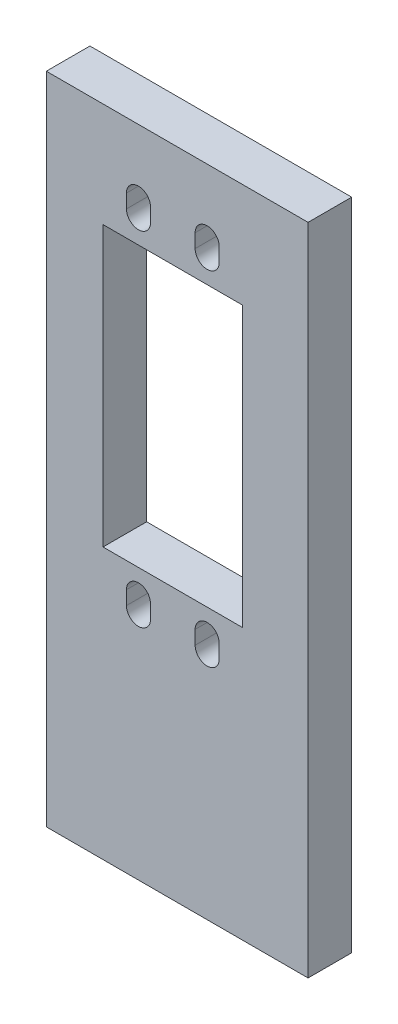
ISO-10303-21;
HEADER;
FILE_DESCRIPTION(('STEP AP214'),'2;1');
FILE_NAME('part.step','',(''),(''),'','','');
FILE_SCHEMA(('AUTOMOTIVE_DESIGN { 1 0 10303 214 1 1 1 1 }'));
ENDSEC;
DATA;
#1=APPLICATION_CONTEXT('core data for automotive mechanical design processes');
#2=APPLICATION_PROTOCOL_DEFINITION('international standard','automotive_design',2000,#1);
#3=PRODUCT_CONTEXT('',#1,'mechanical');
#4=PRODUCT('Part','Part','',(#3));
#5=PRODUCT_RELATED_PRODUCT_CATEGORY('part','',(#4));
#6=PRODUCT_DEFINITION_FORMATION('','',#4);
#7=PRODUCT_DEFINITION_CONTEXT('part definition',#1,'design');
#8=PRODUCT_DEFINITION('design','',#6,#7);
#9=PRODUCT_DEFINITION_SHAPE('','',#8);
#10=(LENGTH_UNIT() NAMED_UNIT(*) SI_UNIT(.MILLI.,.METRE.));
#11=(NAMED_UNIT(*) PLANE_ANGLE_UNIT() SI_UNIT($,.RADIAN.));
#12=(NAMED_UNIT(*) SI_UNIT($,.STERADIAN.) SOLID_ANGLE_UNIT());
#13=UNCERTAINTY_MEASURE_WITH_UNIT(LENGTH_MEASURE(1.E-05),#10,'distance_accuracy_value','');
#14=(GEOMETRIC_REPRESENTATION_CONTEXT(3) GLOBAL_UNCERTAINTY_ASSIGNED_CONTEXT((#13)) GLOBAL_UNIT_ASSIGNED_CONTEXT((#10,
#11,#12)) REPRESENTATION_CONTEXT('',''));
#15=CARTESIAN_POINT('',(0.,0.,0.));
#16=DIRECTION('',(0.,0.,1.));
#17=DIRECTION('',(1.,0.,0.));
#18=AXIS2_PLACEMENT_3D('',#15,#16,#17);
#19=CARTESIAN_POINT('',(0.,0.,6.35));
#20=DIRECTION('',(1.,0.,0.));
#21=DIRECTION('',(0.,0.,-1.));
#22=AXIS2_PLACEMENT_3D('',#19,#20,#21);
#23=PLANE('',#22);
#24=DIRECTION('',(0.,-1.,0.));
#25=VECTOR('',#24,1.);
#26=CARTESIAN_POINT('',(0.,0.,0.));
#27=LINE('',#26,#25);
#28=CARTESIAN_POINT('',(0.,95.25,0.));
#29=VERTEX_POINT('',#28);
#30=CARTESIAN_POINT('',(0.,0.,0.));
#31=VERTEX_POINT('',#30);
#32=EDGE_CURVE('E353',#29,#31,#27,.T.);
#33=ORIENTED_EDGE('',*,*,#32,.T.);
#34=DIRECTION('',(0.,0.,-1.));
#35=VECTOR('',#34,1.);
#36=CARTESIAN_POINT('',(0.,0.,6.35));
#37=LINE('',#36,#35);
#38=CARTESIAN_POINT('',(0.,0.,6.35));
#39=VERTEX_POINT('',#38);
#40=EDGE_CURVE('E11',#39,#31,#37,.T.);
#41=ORIENTED_EDGE('',*,*,#40,.F.);
#42=DIRECTION('',(0.,-1.,0.));
#43=VECTOR('',#42,1.);
#44=CARTESIAN_POINT('',(0.,0.,6.35));
#45=LINE('',#44,#43);
#46=CARTESIAN_POINT('',(0.,95.25,6.35));
#47=VERTEX_POINT('',#46);
#48=EDGE_CURVE('E360',#47,#39,#45,.T.);
#49=ORIENTED_EDGE('',*,*,#48,.F.);
#50=DIRECTION('',(0.,0.,-1.));
#51=VECTOR('',#50,1.);
#52=CARTESIAN_POINT('',(0.,95.25,6.35));
#53=LINE('',#52,#51);
#54=EDGE_CURVE('E370',#47,#29,#53,.T.);
#55=ORIENTED_EDGE('',*,*,#54,.T.);
#56=EDGE_LOOP('',(#33,#41,#49,#55));
#57=FACE_BOUND('',#56,.T.);
#58=ADVANCED_FACE('F35',(#57),#23,.F.);
#59=CARTESIAN_POINT('',(0.,0.,6.35));
#60=DIRECTION('',(0.,1.,0.));
#61=DIRECTION('',(0.,0.,1.));
#62=AXIS2_PLACEMENT_3D('',#59,#60,#61);
#63=PLANE('',#62);
#64=DIRECTION('',(1.,0.,0.));
#65=VECTOR('',#64,1.);
#66=CARTESIAN_POINT('',(0.,0.,0.));
#67=LINE('',#66,#65);
#68=CARTESIAN_POINT('',(38.1,0.,0.));
#69=VERTEX_POINT('',#68);
#70=EDGE_CURVE('E373',#31,#69,#67,.T.);
#71=ORIENTED_EDGE('',*,*,#70,.T.);
#72=DIRECTION('',(0.,0.,-1.));
#73=VECTOR('',#72,1.);
#74=CARTESIAN_POINT('',(38.1,0.,6.35));
#75=LINE('',#74,#73);
#76=CARTESIAN_POINT('',(38.1,0.,6.35));
#77=VERTEX_POINT('',#76);
#78=EDGE_CURVE('E42',#77,#69,#75,.T.);
#79=ORIENTED_EDGE('',*,*,#78,.F.);
#80=DIRECTION('',(1.,0.,0.));
#81=VECTOR('',#80,1.);
#82=CARTESIAN_POINT('',(0.,0.,6.35));
#83=LINE('',#82,#81);
#84=EDGE_CURVE('E363',#39,#77,#83,.T.);
#85=ORIENTED_EDGE('',*,*,#84,.F.);
#86=ORIENTED_EDGE('',*,*,#40,.T.);
#87=EDGE_LOOP('',(#71,#79,#85,#86));
#88=FACE_BOUND('',#87,.T.);
#89=ADVANCED_FACE('F402',(#88),#63,.F.);
#90=CARTESIAN_POINT('',(38.1,0.,6.35));
#91=DIRECTION('',(-1.,0.,0.));
#92=DIRECTION('',(0.,0.,1.));
#93=AXIS2_PLACEMENT_3D('',#90,#91,#92);
#94=PLANE('',#93);
#95=DIRECTION('',(0.,1.,0.));
#96=VECTOR('',#95,1.);
#97=CARTESIAN_POINT('',(38.1,0.,0.));
#98=LINE('',#97,#96);
#99=CARTESIAN_POINT('',(38.1,95.25,0.));
#100=VERTEX_POINT('',#99);
#101=EDGE_CURVE('E375',#69,#100,#98,.T.);
#102=ORIENTED_EDGE('',*,*,#101,.T.);
#103=DIRECTION('',(0.,0.,-1.));
#104=VECTOR('',#103,1.);
#105=CARTESIAN_POINT('',(38.1,95.25,6.35));
#106=LINE('',#105,#104);
#107=CARTESIAN_POINT('',(38.1,95.25,6.35));
#108=VERTEX_POINT('',#107);
#109=EDGE_CURVE('E380',#108,#100,#106,.T.);
#110=ORIENTED_EDGE('',*,*,#109,.F.);
#111=DIRECTION('',(0.,1.,0.));
#112=VECTOR('',#111,1.);
#113=CARTESIAN_POINT('',(38.1,0.,6.35));
#114=LINE('',#113,#112);
#115=EDGE_CURVE('E366',#77,#108,#114,.T.);
#116=ORIENTED_EDGE('',*,*,#115,.F.);
#117=ORIENTED_EDGE('',*,*,#78,.T.);
#118=EDGE_LOOP('',(#102,#110,#116,#117));
#119=FACE_BOUND('',#118,.T.);
#120=ADVANCED_FACE('F387',(#119),#94,.F.);
#121=CARTESIAN_POINT('',(0.,95.25,6.35));
#122=DIRECTION('',(0.,-1.,0.));
#123=DIRECTION('',(0.,0.,-1.));
#124=AXIS2_PLACEMENT_3D('',#121,#122,#123);
#125=PLANE('',#124);
#126=DIRECTION('',(-1.,0.,0.));
#127=VECTOR('',#126,1.);
#128=CARTESIAN_POINT('',(0.,95.25,0.));
#129=LINE('',#128,#127);
#130=EDGE_CURVE('E364',#100,#29,#129,.T.);
#131=ORIENTED_EDGE('',*,*,#130,.T.);
#132=ORIENTED_EDGE('',*,*,#54,.F.);
#133=DIRECTION('',(-1.,0.,0.));
#134=VECTOR('',#133,1.);
#135=CARTESIAN_POINT('',(0.,95.25,6.35));
#136=LINE('',#135,#134);
#137=EDGE_CURVE('E368',#108,#47,#136,.T.);
#138=ORIENTED_EDGE('',*,*,#137,.F.);
#139=ORIENTED_EDGE('',*,*,#109,.T.);
#140=EDGE_LOOP('',(#131,#132,#138,#139));
#141=FACE_BOUND('',#140,.T.);
#142=ADVANCED_FACE('F396',(#141),#125,.F.);
#143=CARTESIAN_POINT('',(0.,0.,6.35));
#144=DIRECTION('',(0.,0.,-1.));
#145=DIRECTION('',(-1.,0.,0.));
#146=AXIS2_PLACEMENT_3D('',#143,#144,#145);
#147=PLANE('',#146);
#148=DIRECTION('',(0.,1.,0.));
#149=VECTOR('',#148,1.);
#150=CARTESIAN_POINT('',(11.6649999999998,35.725,6.35));
#151=LINE('',#150,#149);
#152=CARTESIAN_POINT('',(11.6649999999999,33.725,6.35));
#153=VERTEX_POINT('',#152);
#154=CARTESIAN_POINT('',(11.6649999999998,35.725,6.35));
#155=VERTEX_POINT('',#154);
#156=EDGE_CURVE('E203',#153,#155,#151,.T.);
#157=ORIENTED_EDGE('',*,*,#156,.T.);
#158=CARTESIAN_POINT('',(13.4149999999998,35.725,6.35));
#159=DIRECTION('',(0.,0.,-1.));
#160=DIRECTION('',(-1.,0.,0.));
#161=AXIS2_PLACEMENT_3D('',#158,#159,#160);
#162=CIRCLE('',#161,1.75);
#163=CARTESIAN_POINT('',(15.1649999999998,35.725,6.35));
#164=VERTEX_POINT('',#163);
#165=EDGE_CURVE('E197',#155,#164,#162,.T.);
#166=ORIENTED_EDGE('',*,*,#165,.T.);
#167=DIRECTION('',(0.,-1.,0.));
#168=VECTOR('',#167,1.);
#169=CARTESIAN_POINT('',(15.1649999999998,35.725,6.35));
#170=LINE('',#169,#168);
#171=CARTESIAN_POINT('',(15.1649999999998,33.725,6.35));
#172=VERTEX_POINT('',#171);
#173=EDGE_CURVE('E206',#164,#172,#170,.T.);
#174=ORIENTED_EDGE('',*,*,#173,.T.);
#175=CARTESIAN_POINT('',(13.4149999999998,33.725,6.35));
#176=DIRECTION('',(0.,0.,-1.));
#177=DIRECTION('',(-1.,0.,0.));
#178=AXIS2_PLACEMENT_3D('',#175,#176,#177);
#179=CIRCLE('',#178,1.74999999999999);
#180=EDGE_CURVE('E49',#172,#153,#179,.T.);
#181=ORIENTED_EDGE('',*,*,#180,.T.);
#182=EDGE_LOOP('',(#157,#166,#174,#181));
#183=FACE_BOUND('',#182,.T.);
#184=DIRECTION('',(0.,1.,0.));
#185=VECTOR('',#184,1.);
#186=CARTESIAN_POINT('',(21.6649999999998,35.725,6.35));
#187=LINE('',#186,#185);
#188=CARTESIAN_POINT('',(21.6649999999999,33.725,6.35));
#189=VERTEX_POINT('',#188);
#190=CARTESIAN_POINT('',(21.6649999999998,35.725,6.35));
#191=VERTEX_POINT('',#190);
#192=EDGE_CURVE('E242',#189,#191,#187,.T.);
#193=ORIENTED_EDGE('',*,*,#192,.T.);
#194=CARTESIAN_POINT('',(23.4149999999998,35.725,6.35));
#195=DIRECTION('',(0.,0.,-1.));
#196=DIRECTION('',(-1.,0.,0.));
#197=AXIS2_PLACEMENT_3D('',#194,#195,#196);
#198=CIRCLE('',#197,1.74999999999999);
#199=CARTESIAN_POINT('',(25.1649999999998,35.725,6.35));
#200=VERTEX_POINT('',#199);
#201=EDGE_CURVE('E232',#191,#200,#198,.T.);
#202=ORIENTED_EDGE('',*,*,#201,.T.);
#203=DIRECTION('',(0.,-1.,0.));
#204=VECTOR('',#203,1.);
#205=CARTESIAN_POINT('',(25.1649999999998,35.725,6.35));
#206=LINE('',#205,#204);
#207=CARTESIAN_POINT('',(25.1649999999998,33.725,6.35));
#208=VERTEX_POINT('',#207);
#209=EDGE_CURVE('E235',#200,#208,#206,.T.);
#210=ORIENTED_EDGE('',*,*,#209,.T.);
#211=CARTESIAN_POINT('',(23.4149999999998,33.725,6.35));
#212=DIRECTION('',(0.,0.,-1.));
#213=DIRECTION('',(-1.,0.,0.));
#214=AXIS2_PLACEMENT_3D('',#211,#212,#213);
#215=CIRCLE('',#214,1.74999999999999);
#216=EDGE_CURVE('E239',#208,#189,#215,.T.);
#217=ORIENTED_EDGE('',*,*,#216,.T.);
#218=EDGE_LOOP('',(#193,#202,#210,#217));
#219=FACE_BOUND('',#218,.T.);
#220=DIRECTION('',(0.,-1.,0.));
#221=VECTOR('',#220,1.);
#222=CARTESIAN_POINT('',(15.165,83.725,6.35));
#223=LINE('',#222,#221);
#224=CARTESIAN_POINT('',(15.165,85.725,6.35));
#225=VERTEX_POINT('',#224);
#226=CARTESIAN_POINT('',(15.165,83.725,6.35));
#227=VERTEX_POINT('',#226);
#228=EDGE_CURVE('E274',#225,#227,#223,.T.);
#229=ORIENTED_EDGE('',*,*,#228,.T.);
#230=CARTESIAN_POINT('',(13.415,83.725,6.35));
#231=DIRECTION('',(0.,0.,-1.));
#232=DIRECTION('',(-1.,0.,0.));
#233=AXIS2_PLACEMENT_3D('',#230,#231,#232);
#234=CIRCLE('',#233,1.75);
#235=CARTESIAN_POINT('',(11.665,83.725,6.35));
#236=VERTEX_POINT('',#235);
#237=EDGE_CURVE('E264',#227,#236,#234,.T.);
#238=ORIENTED_EDGE('',*,*,#237,.T.);
#239=DIRECTION('',(0.,1.,0.));
#240=VECTOR('',#239,1.);
#241=CARTESIAN_POINT('',(11.665,83.725,6.35));
#242=LINE('',#241,#240);
#243=CARTESIAN_POINT('',(11.665,85.725,6.35));
#244=VERTEX_POINT('',#243);
#245=EDGE_CURVE('E267',#236,#244,#242,.T.);
#246=ORIENTED_EDGE('',*,*,#245,.T.);
#247=CARTESIAN_POINT('',(13.415,85.725,6.35));
#248=DIRECTION('',(0.,0.,-1.));
#249=DIRECTION('',(-1.,0.,0.));
#250=AXIS2_PLACEMENT_3D('',#247,#248,#249);
#251=CIRCLE('',#250,1.75);
#252=EDGE_CURVE('E271',#244,#225,#251,.T.);
#253=ORIENTED_EDGE('',*,*,#252,.T.);
#254=EDGE_LOOP('',(#229,#238,#246,#253));
#255=FACE_BOUND('',#254,.T.);
#256=DIRECTION('',(0.,-1.,0.));
#257=VECTOR('',#256,1.);
#258=CARTESIAN_POINT('',(25.165,83.725,6.35));
#259=LINE('',#258,#257);
#260=CARTESIAN_POINT('',(25.165,85.725,6.35));
#261=VERTEX_POINT('',#260);
#262=CARTESIAN_POINT('',(25.165,83.725,6.35));
#263=VERTEX_POINT('',#262);
#264=EDGE_CURVE('E306',#261,#263,#259,.T.);
#265=ORIENTED_EDGE('',*,*,#264,.T.);
#266=CARTESIAN_POINT('',(23.415,83.725,6.35));
#267=DIRECTION('',(0.,0.,-1.));
#268=DIRECTION('',(-1.,0.,0.));
#269=AXIS2_PLACEMENT_3D('',#266,#267,#268);
#270=CIRCLE('',#269,1.75000000000001);
#271=CARTESIAN_POINT('',(21.665,83.725,6.35));
#272=VERTEX_POINT('',#271);
#273=EDGE_CURVE('E296',#263,#272,#270,.T.);
#274=ORIENTED_EDGE('',*,*,#273,.T.);
#275=DIRECTION('',(0.,1.,0.));
#276=VECTOR('',#275,1.);
#277=CARTESIAN_POINT('',(21.665,83.725,6.35));
#278=LINE('',#277,#276);
#279=CARTESIAN_POINT('',(21.665,85.725,6.35));
#280=VERTEX_POINT('',#279);
#281=EDGE_CURVE('E299',#272,#280,#278,.T.);
#282=ORIENTED_EDGE('',*,*,#281,.T.);
#283=CARTESIAN_POINT('',(23.415,85.725,6.35));
#284=DIRECTION('',(0.,0.,-1.));
#285=DIRECTION('',(-1.,0.,0.));
#286=AXIS2_PLACEMENT_3D('',#283,#284,#285);
#287=CIRCLE('',#286,1.75000000000001);
#288=EDGE_CURVE('E303',#280,#261,#287,.T.);
#289=ORIENTED_EDGE('',*,*,#288,.T.);
#290=EDGE_LOOP('',(#265,#274,#282,#289));
#291=FACE_BOUND('',#290,.T.);
#292=DIRECTION('',(0.,-1.,0.));
#293=VECTOR('',#292,1.);
#294=CARTESIAN_POINT('',(28.575,80.045,6.35));
#295=LINE('',#294,#293);
#296=CARTESIAN_POINT('',(28.575,80.045,6.35));
#297=VERTEX_POINT('',#296);
#298=CARTESIAN_POINT('',(28.5749999999999,39.405,6.35));
#299=VERTEX_POINT('',#298);
#300=EDGE_CURVE('E338',#297,#299,#295,.T.);
#301=ORIENTED_EDGE('',*,*,#300,.T.);
#302=DIRECTION('',(-1.,0.,0.));
#303=VECTOR('',#302,1.);
#304=CARTESIAN_POINT('',(8.25499999999986,39.405,6.35));
#305=LINE('',#304,#303);
#306=CARTESIAN_POINT('',(8.25499999999986,39.405,6.35));
#307=VERTEX_POINT('',#306);
#308=EDGE_CURVE('E328',#299,#307,#305,.T.);
#309=ORIENTED_EDGE('',*,*,#308,.T.);
#310=DIRECTION('',(0.,1.,0.));
#311=VECTOR('',#310,1.);
#312=CARTESIAN_POINT('',(8.25500000000001,80.045,6.35));
#313=LINE('',#312,#311);
#314=CARTESIAN_POINT('',(8.25500000000001,80.045,6.35));
#315=VERTEX_POINT('',#314);
#316=EDGE_CURVE('E331',#307,#315,#313,.T.);
#317=ORIENTED_EDGE('',*,*,#316,.T.);
#318=DIRECTION('',(1.,0.,0.));
#319=VECTOR('',#318,1.);
#320=CARTESIAN_POINT('',(8.25500000000001,80.045,6.35));
#321=LINE('',#320,#319);
#322=EDGE_CURVE('E335',#315,#297,#321,.T.);
#323=ORIENTED_EDGE('',*,*,#322,.T.);
#324=EDGE_LOOP('',(#301,#309,#317,#323));
#325=FACE_BOUND('',#324,.T.);
#326=ORIENTED_EDGE('',*,*,#48,.T.);
#327=ORIENTED_EDGE('',*,*,#84,.T.);
#328=ORIENTED_EDGE('',*,*,#115,.T.);
#329=ORIENTED_EDGE('',*,*,#137,.T.);
#330=EDGE_LOOP('',(#326,#327,#328,#329));
#331=FACE_BOUND('',#330,.T.);
#332=ADVANCED_FACE('F210',(#183,#219,#255,#291,#325,#331),#147,.F.);
#333=CARTESIAN_POINT('',(0.,0.,0.));
#334=DIRECTION('',(0.,0.,-1.));
#335=DIRECTION('',(-1.,0.,0.));
#336=AXIS2_PLACEMENT_3D('',#333,#334,#335);
#337=PLANE('',#336);
#338=CARTESIAN_POINT('',(13.4149999999998,35.725,0.));
#339=DIRECTION('',(0.,0.,-1.));
#340=DIRECTION('',(-1.,0.,0.));
#341=AXIS2_PLACEMENT_3D('',#338,#339,#340);
#342=CIRCLE('',#341,1.75);
#343=CARTESIAN_POINT('',(11.6649999999998,35.725,0.));
#344=VERTEX_POINT('',#343);
#345=CARTESIAN_POINT('',(15.1649999999998,35.725,0.));
#346=VERTEX_POINT('',#345);
#347=EDGE_CURVE('E57',#344,#346,#342,.T.);
#348=ORIENTED_EDGE('',*,*,#347,.F.);
#349=DIRECTION('',(0.,1.,0.));
#350=VECTOR('',#349,1.);
#351=CARTESIAN_POINT('',(11.6649999999998,35.725,0.));
#352=LINE('',#351,#350);
#353=CARTESIAN_POINT('',(11.6649999999999,33.725,0.));
#354=VERTEX_POINT('',#353);
#355=EDGE_CURVE('E213',#354,#344,#352,.T.);
#356=ORIENTED_EDGE('',*,*,#355,.F.);
#357=CARTESIAN_POINT('',(13.4149999999998,33.725,0.));
#358=DIRECTION('',(0.,0.,-1.));
#359=DIRECTION('',(-1.,0.,0.));
#360=AXIS2_PLACEMENT_3D('',#357,#358,#359);
#361=CIRCLE('',#360,1.74999999999999);
#362=CARTESIAN_POINT('',(15.1649999999998,33.725,0.));
#363=VERTEX_POINT('',#362);
#364=EDGE_CURVE('E216',#363,#354,#361,.T.);
#365=ORIENTED_EDGE('',*,*,#364,.F.);
#366=DIRECTION('',(0.,-1.,0.));
#367=VECTOR('',#366,1.);
#368=CARTESIAN_POINT('',(15.1649999999998,35.725,0.));
#369=LINE('',#368,#367);
#370=EDGE_CURVE('E222',#346,#363,#369,.T.);
#371=ORIENTED_EDGE('',*,*,#370,.F.);
#372=EDGE_LOOP('',(#348,#356,#365,#371));
#373=FACE_BOUND('',#372,.T.);
#374=CARTESIAN_POINT('',(23.4149999999998,35.725,0.));
#375=DIRECTION('',(0.,0.,-1.));
#376=DIRECTION('',(-1.,0.,0.));
#377=AXIS2_PLACEMENT_3D('',#374,#375,#376);
#378=CIRCLE('',#377,1.74999999999999);
#379=CARTESIAN_POINT('',(21.6649999999998,35.725,0.));
#380=VERTEX_POINT('',#379);
#381=CARTESIAN_POINT('',(25.1649999999998,35.725,0.));
#382=VERTEX_POINT('',#381);
#383=EDGE_CURVE('E228',#380,#382,#378,.T.);
#384=ORIENTED_EDGE('',*,*,#383,.F.);
#385=DIRECTION('',(0.,1.,0.));
#386=VECTOR('',#385,1.);
#387=CARTESIAN_POINT('',(21.6649999999998,35.725,0.));
#388=LINE('',#387,#386);
#389=CARTESIAN_POINT('',(21.6649999999999,33.725,0.));
#390=VERTEX_POINT('',#389);
#391=EDGE_CURVE('E236',#390,#380,#388,.T.);
#392=ORIENTED_EDGE('',*,*,#391,.F.);
#393=CARTESIAN_POINT('',(23.4149999999998,33.725,0.));
#394=DIRECTION('',(0.,0.,-1.));
#395=DIRECTION('',(-1.,0.,0.));
#396=AXIS2_PLACEMENT_3D('',#393,#394,#395);
#397=CIRCLE('',#396,1.74999999999999);
#398=CARTESIAN_POINT('',(25.1649999999998,33.725,0.));
#399=VERTEX_POINT('',#398);
#400=EDGE_CURVE('E250',#399,#390,#397,.T.);
#401=ORIENTED_EDGE('',*,*,#400,.F.);
#402=DIRECTION('',(0.,-1.,0.));
#403=VECTOR('',#402,1.);
#404=CARTESIAN_POINT('',(25.1649999999998,35.725,0.));
#405=LINE('',#404,#403);
#406=EDGE_CURVE('E247',#382,#399,#405,.T.);
#407=ORIENTED_EDGE('',*,*,#406,.F.);
#408=EDGE_LOOP('',(#384,#392,#401,#407));
#409=FACE_BOUND('',#408,.T.);
#410=CARTESIAN_POINT('',(13.415,83.725,0.));
#411=DIRECTION('',(0.,0.,-1.));
#412=DIRECTION('',(-1.,0.,0.));
#413=AXIS2_PLACEMENT_3D('',#410,#411,#412);
#414=CIRCLE('',#413,1.75);
#415=CARTESIAN_POINT('',(15.165,83.725,0.));
#416=VERTEX_POINT('',#415);
#417=CARTESIAN_POINT('',(11.665,83.725,0.));
#418=VERTEX_POINT('',#417);
#419=EDGE_CURVE('E257',#416,#418,#414,.T.);
#420=ORIENTED_EDGE('',*,*,#419,.F.);
#421=DIRECTION('',(0.,-1.,0.));
#422=VECTOR('',#421,1.);
#423=CARTESIAN_POINT('',(15.165,83.725,0.));
#424=LINE('',#423,#422);
#425=CARTESIAN_POINT('',(15.165,85.725,0.));
#426=VERTEX_POINT('',#425);
#427=EDGE_CURVE('E268',#426,#416,#424,.T.);
#428=ORIENTED_EDGE('',*,*,#427,.F.);
#429=CARTESIAN_POINT('',(13.415,85.725,0.));
#430=DIRECTION('',(0.,0.,-1.));
#431=DIRECTION('',(-1.,0.,0.));
#432=AXIS2_PLACEMENT_3D('',#429,#430,#431);
#433=CIRCLE('',#432,1.75);
#434=CARTESIAN_POINT('',(11.665,85.725,0.));
#435=VERTEX_POINT('',#434);
#436=EDGE_CURVE('E282',#435,#426,#433,.T.);
#437=ORIENTED_EDGE('',*,*,#436,.F.);
#438=DIRECTION('',(0.,1.,0.));
#439=VECTOR('',#438,1.);
#440=CARTESIAN_POINT('',(11.665,83.725,0.));
#441=LINE('',#440,#439);
#442=EDGE_CURVE('E279',#418,#435,#441,.T.);
#443=ORIENTED_EDGE('',*,*,#442,.F.);
#444=EDGE_LOOP('',(#420,#428,#437,#443));
#445=FACE_BOUND('',#444,.T.);
#446=CARTESIAN_POINT('',(23.415,83.725,0.));
#447=DIRECTION('',(0.,0.,-1.));
#448=DIRECTION('',(-1.,0.,0.));
#449=AXIS2_PLACEMENT_3D('',#446,#447,#448);
#450=CIRCLE('',#449,1.75000000000001);
#451=CARTESIAN_POINT('',(25.165,83.725,0.));
#452=VERTEX_POINT('',#451);
#453=CARTESIAN_POINT('',(21.665,83.725,0.));
#454=VERTEX_POINT('',#453);
#455=EDGE_CURVE('E289',#452,#454,#450,.T.);
#456=ORIENTED_EDGE('',*,*,#455,.F.);
#457=DIRECTION('',(0.,-1.,0.));
#458=VECTOR('',#457,1.);
#459=CARTESIAN_POINT('',(25.165,83.725,0.));
#460=LINE('',#459,#458);
#461=CARTESIAN_POINT('',(25.165,85.725,0.));
#462=VERTEX_POINT('',#461);
#463=EDGE_CURVE('E300',#462,#452,#460,.T.);
#464=ORIENTED_EDGE('',*,*,#463,.F.);
#465=CARTESIAN_POINT('',(23.415,85.725,0.));
#466=DIRECTION('',(0.,0.,-1.));
#467=DIRECTION('',(-1.,0.,0.));
#468=AXIS2_PLACEMENT_3D('',#465,#466,#467);
#469=CIRCLE('',#468,1.75000000000001);
#470=CARTESIAN_POINT('',(21.665,85.725,0.));
#471=VERTEX_POINT('',#470);
#472=EDGE_CURVE('E314',#471,#462,#469,.T.);
#473=ORIENTED_EDGE('',*,*,#472,.F.);
#474=DIRECTION('',(0.,1.,0.));
#475=VECTOR('',#474,1.);
#476=CARTESIAN_POINT('',(21.665,83.725,0.));
#477=LINE('',#476,#475);
#478=EDGE_CURVE('E311',#454,#471,#477,.T.);
#479=ORIENTED_EDGE('',*,*,#478,.F.);
#480=EDGE_LOOP('',(#456,#464,#473,#479));
#481=FACE_BOUND('',#480,.T.);
#482=DIRECTION('',(-1.,0.,0.));
#483=VECTOR('',#482,1.);
#484=CARTESIAN_POINT('',(8.25499999999986,39.405,0.));
#485=LINE('',#484,#483);
#486=CARTESIAN_POINT('',(28.5749999999999,39.405,0.));
#487=VERTEX_POINT('',#486);
#488=CARTESIAN_POINT('',(8.25499999999986,39.405,0.));
#489=VERTEX_POINT('',#488);
#490=EDGE_CURVE('E321',#487,#489,#485,.T.);
#491=ORIENTED_EDGE('',*,*,#490,.F.);
#492=DIRECTION('',(0.,-1.,0.));
#493=VECTOR('',#492,1.);
#494=CARTESIAN_POINT('',(28.575,80.045,0.));
#495=LINE('',#494,#493);
#496=CARTESIAN_POINT('',(28.575,80.045,0.));
#497=VERTEX_POINT('',#496);
#498=EDGE_CURVE('E332',#497,#487,#495,.T.);
#499=ORIENTED_EDGE('',*,*,#498,.F.);
#500=DIRECTION('',(1.,0.,0.));
#501=VECTOR('',#500,1.);
#502=CARTESIAN_POINT('',(8.25500000000001,80.045,0.));
#503=LINE('',#502,#501);
#504=CARTESIAN_POINT('',(8.25500000000001,80.045,0.));
#505=VERTEX_POINT('',#504);
#506=EDGE_CURVE('E346',#505,#497,#503,.T.);
#507=ORIENTED_EDGE('',*,*,#506,.F.);
#508=DIRECTION('',(0.,1.,0.));
#509=VECTOR('',#508,1.);
#510=CARTESIAN_POINT('',(8.25500000000001,80.045,0.));
#511=LINE('',#510,#509);
#512=EDGE_CURVE('E343',#489,#505,#511,.T.);
#513=ORIENTED_EDGE('',*,*,#512,.F.);
#514=EDGE_LOOP('',(#491,#499,#507,#513));
#515=FACE_BOUND('',#514,.T.);
#516=ORIENTED_EDGE('',*,*,#32,.F.);
#517=ORIENTED_EDGE('',*,*,#130,.F.);
#518=ORIENTED_EDGE('',*,*,#101,.F.);
#519=ORIENTED_EDGE('',*,*,#70,.F.);
#520=EDGE_LOOP('',(#516,#517,#518,#519));
#521=FACE_BOUND('',#520,.T.);
#522=ADVANCED_FACE('F393',(#373,#409,#445,#481,#515,#521),#337,.T.);
#523=CARTESIAN_POINT('',(8.25499999999986,39.405,6.35));
#524=DIRECTION('',(0.,-1.,0.));
#525=DIRECTION('',(1.,0.,0.));
#526=AXIS2_PLACEMENT_3D('',#523,#524,#525);
#527=PLANE('',#526);
#528=ORIENTED_EDGE('',*,*,#490,.T.);
#529=DIRECTION('',(0.,0.,-1.));
#530=VECTOR('',#529,1.);
#531=CARTESIAN_POINT('',(8.25499999999986,39.405,6.35));
#532=LINE('',#531,#530);
#533=EDGE_CURVE('E341',#307,#489,#532,.T.);
#534=ORIENTED_EDGE('',*,*,#533,.F.);
#535=ORIENTED_EDGE('',*,*,#308,.F.);
#536=DIRECTION('',(0.,0.,-1.));
#537=VECTOR('',#536,1.);
#538=CARTESIAN_POINT('',(28.5749999999999,39.405,6.35));
#539=LINE('',#538,#537);
#540=EDGE_CURVE('E351',#299,#487,#539,.T.);
#541=ORIENTED_EDGE('',*,*,#540,.T.);
#542=EDGE_LOOP('',(#528,#534,#535,#541));
#543=FACE_BOUND('',#542,.T.);
#544=ADVANCED_FACE('F414',(#543),#527,.F.);
#545=CARTESIAN_POINT('',(28.575,80.045,6.35));
#546=DIRECTION('',(1.,0.,0.));
#547=DIRECTION('',(0.,1.,0.));
#548=AXIS2_PLACEMENT_3D('',#545,#546,#547);
#549=PLANE('',#548);
#550=ORIENTED_EDGE('',*,*,#498,.T.);
#551=ORIENTED_EDGE('',*,*,#540,.F.);
#552=ORIENTED_EDGE('',*,*,#300,.F.);
#553=DIRECTION('',(0.,0.,-1.));
#554=VECTOR('',#553,1.);
#555=CARTESIAN_POINT('',(28.575,80.045,6.35));
#556=LINE('',#555,#554);
#557=EDGE_CURVE('E354',#297,#497,#556,.T.);
#558=ORIENTED_EDGE('',*,*,#557,.T.);
#559=EDGE_LOOP('',(#550,#551,#552,#558));
#560=FACE_BOUND('',#559,.T.);
#561=ADVANCED_FACE('F420',(#560),#549,.F.);
#562=CARTESIAN_POINT('',(8.25500000000001,80.045,6.35));
#563=DIRECTION('',(0.,1.,0.));
#564=DIRECTION('',(-1.,0.,0.));
#565=AXIS2_PLACEMENT_3D('',#562,#563,#564);
#566=PLANE('',#565);
#567=ORIENTED_EDGE('',*,*,#506,.T.);
#568=ORIENTED_EDGE('',*,*,#557,.F.);
#569=ORIENTED_EDGE('',*,*,#322,.F.);
#570=DIRECTION('',(0.,0.,-1.));
#571=VECTOR('',#570,1.);
#572=CARTESIAN_POINT('',(8.25500000000001,80.045,6.35));
#573=LINE('',#572,#571);
#574=EDGE_CURVE('E356',#315,#505,#573,.T.);
#575=ORIENTED_EDGE('',*,*,#574,.T.);
#576=EDGE_LOOP('',(#567,#568,#569,#575));
#577=FACE_BOUND('',#576,.T.);
#578=ADVANCED_FACE('F426',(#577),#566,.F.);
#579=CARTESIAN_POINT('',(8.25500000000001,80.045,6.35));
#580=DIRECTION('',(-1.,0.,0.));
#581=DIRECTION('',(0.,-1.,0.));
#582=AXIS2_PLACEMENT_3D('',#579,#580,#581);
#583=PLANE('',#582);
#584=ORIENTED_EDGE('',*,*,#512,.T.);
#585=ORIENTED_EDGE('',*,*,#574,.F.);
#586=ORIENTED_EDGE('',*,*,#316,.F.);
#587=ORIENTED_EDGE('',*,*,#533,.T.);
#588=EDGE_LOOP('',(#584,#585,#586,#587));
#589=FACE_BOUND('',#588,.T.);
#590=ADVANCED_FACE('F422',(#589),#583,.F.);
#591=CARTESIAN_POINT('',(23.415,83.725,6.35));
#592=DIRECTION('',(0.,0.,-1.));
#593=DIRECTION('',(-1.,0.,0.));
#594=AXIS2_PLACEMENT_3D('',#591,#592,#593);
#595=CYLINDRICAL_SURFACE('',#594,1.75000000000001);
#596=ORIENTED_EDGE('',*,*,#455,.T.);
#597=DIRECTION('',(0.,0.,-1.));
#598=VECTOR('',#597,1.);
#599=CARTESIAN_POINT('',(21.665,83.725,6.35));
#600=LINE('',#599,#598);
#601=EDGE_CURVE('E309',#272,#454,#600,.T.);
#602=ORIENTED_EDGE('',*,*,#601,.F.);
#603=ORIENTED_EDGE('',*,*,#273,.F.);
#604=DIRECTION('',(0.,0.,-1.));
#605=VECTOR('',#604,1.);
#606=CARTESIAN_POINT('',(25.165,83.725,6.35));
#607=LINE('',#606,#605);
#608=EDGE_CURVE('E319',#263,#452,#607,.T.);
#609=ORIENTED_EDGE('',*,*,#608,.T.);
#610=EDGE_LOOP('',(#596,#602,#603,#609));
#611=FACE_BOUND('',#610,.T.);
#612=ADVANCED_FACE('F425',(#611),#595,.F.);
#613=CARTESIAN_POINT('',(25.165,83.725,6.35));
#614=DIRECTION('',(1.,0.,0.));
#615=DIRECTION('',(0.,1.,0.));
#616=AXIS2_PLACEMENT_3D('',#613,#614,#615);
#617=PLANE('',#616);
#618=ORIENTED_EDGE('',*,*,#463,.T.);
#619=ORIENTED_EDGE('',*,*,#608,.F.);
#620=ORIENTED_EDGE('',*,*,#264,.F.);
#621=DIRECTION('',(0.,0.,-1.));
#622=VECTOR('',#621,1.);
#623=CARTESIAN_POINT('',(25.165,85.725,6.35));
#624=LINE('',#623,#622);
#625=EDGE_CURVE('E322',#261,#462,#624,.T.);
#626=ORIENTED_EDGE('',*,*,#625,.T.);
#627=EDGE_LOOP('',(#618,#619,#620,#626));
#628=FACE_BOUND('',#627,.T.);
#629=ADVANCED_FACE('F436',(#628),#617,.F.);
#630=CARTESIAN_POINT('',(23.415,85.725,6.35));
#631=DIRECTION('',(0.,0.,-1.));
#632=DIRECTION('',(-1.,0.,0.));
#633=AXIS2_PLACEMENT_3D('',#630,#631,#632);
#634=CYLINDRICAL_SURFACE('',#633,1.75000000000001);
#635=ORIENTED_EDGE('',*,*,#472,.T.);
#636=ORIENTED_EDGE('',*,*,#625,.F.);
#637=ORIENTED_EDGE('',*,*,#288,.F.);
#638=DIRECTION('',(0.,0.,-1.));
#639=VECTOR('',#638,1.);
#640=CARTESIAN_POINT('',(21.665,85.725,6.35));
#641=LINE('',#640,#639);
#642=EDGE_CURVE('E324',#280,#471,#641,.T.);
#643=ORIENTED_EDGE('',*,*,#642,.T.);
#644=EDGE_LOOP('',(#635,#636,#637,#643));
#645=FACE_BOUND('',#644,.T.);
#646=ADVANCED_FACE('F442',(#645),#634,.F.);
#647=CARTESIAN_POINT('',(21.665,83.725,6.35));
#648=DIRECTION('',(-1.,0.,0.));
#649=DIRECTION('',(0.,-1.,0.));
#650=AXIS2_PLACEMENT_3D('',#647,#648,#649);
#651=PLANE('',#650);
#652=ORIENTED_EDGE('',*,*,#478,.T.);
#653=ORIENTED_EDGE('',*,*,#642,.F.);
#654=ORIENTED_EDGE('',*,*,#281,.F.);
#655=ORIENTED_EDGE('',*,*,#601,.T.);
#656=EDGE_LOOP('',(#652,#653,#654,#655));
#657=FACE_BOUND('',#656,.T.);
#658=ADVANCED_FACE('F438',(#657),#651,.F.);
#659=CARTESIAN_POINT('',(13.415,83.725,6.35));
#660=DIRECTION('',(0.,0.,-1.));
#661=DIRECTION('',(-1.,0.,0.));
#662=AXIS2_PLACEMENT_3D('',#659,#660,#661);
#663=CYLINDRICAL_SURFACE('',#662,1.75);
#664=ORIENTED_EDGE('',*,*,#419,.T.);
#665=DIRECTION('',(0.,0.,-1.));
#666=VECTOR('',#665,1.);
#667=CARTESIAN_POINT('',(11.665,83.725,6.35));
#668=LINE('',#667,#666);
#669=EDGE_CURVE('E277',#236,#418,#668,.T.);
#670=ORIENTED_EDGE('',*,*,#669,.F.);
#671=ORIENTED_EDGE('',*,*,#237,.F.);
#672=DIRECTION('',(0.,0.,-1.));
#673=VECTOR('',#672,1.);
#674=CARTESIAN_POINT('',(15.165,83.725,6.35));
#675=LINE('',#674,#673);
#676=EDGE_CURVE('E287',#227,#416,#675,.T.);
#677=ORIENTED_EDGE('',*,*,#676,.T.);
#678=EDGE_LOOP('',(#664,#670,#671,#677));
#679=FACE_BOUND('',#678,.T.);
#680=ADVANCED_FACE('F441',(#679),#663,.F.);
#681=CARTESIAN_POINT('',(15.165,83.725,6.35));
#682=DIRECTION('',(1.,0.,0.));
#683=DIRECTION('',(0.,1.,0.));
#684=AXIS2_PLACEMENT_3D('',#681,#682,#683);
#685=PLANE('',#684);
#686=ORIENTED_EDGE('',*,*,#427,.T.);
#687=ORIENTED_EDGE('',*,*,#676,.F.);
#688=ORIENTED_EDGE('',*,*,#228,.F.);
#689=DIRECTION('',(0.,0.,-1.));
#690=VECTOR('',#689,1.);
#691=CARTESIAN_POINT('',(15.165,85.725,6.35));
#692=LINE('',#691,#690);
#693=EDGE_CURVE('E290',#225,#426,#692,.T.);
#694=ORIENTED_EDGE('',*,*,#693,.T.);
#695=EDGE_LOOP('',(#686,#687,#688,#694));
#696=FACE_BOUND('',#695,.T.);
#697=ADVANCED_FACE('F452',(#696),#685,.F.);
#698=CARTESIAN_POINT('',(13.415,85.725,6.35));
#699=DIRECTION('',(0.,0.,-1.));
#700=DIRECTION('',(-1.,0.,0.));
#701=AXIS2_PLACEMENT_3D('',#698,#699,#700);
#702=CYLINDRICAL_SURFACE('',#701,1.75);
#703=ORIENTED_EDGE('',*,*,#436,.T.);
#704=ORIENTED_EDGE('',*,*,#693,.F.);
#705=ORIENTED_EDGE('',*,*,#252,.F.);
#706=DIRECTION('',(0.,0.,-1.));
#707=VECTOR('',#706,1.);
#708=CARTESIAN_POINT('',(11.665,85.725,6.35));
#709=LINE('',#708,#707);
#710=EDGE_CURVE('E292',#244,#435,#709,.T.);
#711=ORIENTED_EDGE('',*,*,#710,.T.);
#712=EDGE_LOOP('',(#703,#704,#705,#711));
#713=FACE_BOUND('',#712,.T.);
#714=ADVANCED_FACE('F458',(#713),#702,.F.);
#715=CARTESIAN_POINT('',(11.665,83.725,6.35));
#716=DIRECTION('',(-1.,0.,0.));
#717=DIRECTION('',(0.,-1.,0.));
#718=AXIS2_PLACEMENT_3D('',#715,#716,#717);
#719=PLANE('',#718);
#720=ORIENTED_EDGE('',*,*,#442,.T.);
#721=ORIENTED_EDGE('',*,*,#710,.F.);
#722=ORIENTED_EDGE('',*,*,#245,.F.);
#723=ORIENTED_EDGE('',*,*,#669,.T.);
#724=EDGE_LOOP('',(#720,#721,#722,#723));
#725=FACE_BOUND('',#724,.T.);
#726=ADVANCED_FACE('F454',(#725),#719,.F.);
#727=CARTESIAN_POINT('',(23.4149999999998,35.725,6.35));
#728=DIRECTION('',(0.,0.,-1.));
#729=DIRECTION('',(-1.,0.,0.));
#730=AXIS2_PLACEMENT_3D('',#727,#728,#729);
#731=CYLINDRICAL_SURFACE('',#730,1.74999999999999);
#732=ORIENTED_EDGE('',*,*,#383,.T.);
#733=DIRECTION('',(0.,0.,-1.));
#734=VECTOR('',#733,1.);
#735=CARTESIAN_POINT('',(25.1649999999998,35.725,6.35));
#736=LINE('',#735,#734);
#737=EDGE_CURVE('E245',#200,#382,#736,.T.);
#738=ORIENTED_EDGE('',*,*,#737,.F.);
#739=ORIENTED_EDGE('',*,*,#201,.F.);
#740=DIRECTION('',(0.,0.,-1.));
#741=VECTOR('',#740,1.);
#742=CARTESIAN_POINT('',(21.6649999999998,35.725,6.35));
#743=LINE('',#742,#741);
#744=EDGE_CURVE('E255',#191,#380,#743,.T.);
#745=ORIENTED_EDGE('',*,*,#744,.T.);
#746=EDGE_LOOP('',(#732,#738,#739,#745));
#747=FACE_BOUND('',#746,.T.);
#748=ADVANCED_FACE('F457',(#747),#731,.F.);
#749=CARTESIAN_POINT('',(21.6649999999998,35.725,6.35));
#750=DIRECTION('',(-1.,0.,0.));
#751=DIRECTION('',(0.,-1.,0.));
#752=AXIS2_PLACEMENT_3D('',#749,#750,#751);
#753=PLANE('',#752);
#754=ORIENTED_EDGE('',*,*,#391,.T.);
#755=ORIENTED_EDGE('',*,*,#744,.F.);
#756=ORIENTED_EDGE('',*,*,#192,.F.);
#757=DIRECTION('',(0.,0.,-1.));
#758=VECTOR('',#757,1.);
#759=CARTESIAN_POINT('',(21.6649999999999,33.725,6.35));
#760=LINE('',#759,#758);
#761=EDGE_CURVE('E258',#189,#390,#760,.T.);
#762=ORIENTED_EDGE('',*,*,#761,.T.);
#763=EDGE_LOOP('',(#754,#755,#756,#762));
#764=FACE_BOUND('',#763,.T.);
#765=ADVANCED_FACE('F468',(#764),#753,.F.);
#766=CARTESIAN_POINT('',(23.4149999999998,33.725,6.35));
#767=DIRECTION('',(0.,0.,-1.));
#768=DIRECTION('',(-1.,0.,0.));
#769=AXIS2_PLACEMENT_3D('',#766,#767,#768);
#770=CYLINDRICAL_SURFACE('',#769,1.74999999999999);
#771=ORIENTED_EDGE('',*,*,#400,.T.);
#772=ORIENTED_EDGE('',*,*,#761,.F.);
#773=ORIENTED_EDGE('',*,*,#216,.F.);
#774=DIRECTION('',(0.,0.,-1.));
#775=VECTOR('',#774,1.);
#776=CARTESIAN_POINT('',(25.1649999999998,33.725,6.35));
#777=LINE('',#776,#775);
#778=EDGE_CURVE('E260',#208,#399,#777,.T.);
#779=ORIENTED_EDGE('',*,*,#778,.T.);
#780=EDGE_LOOP('',(#771,#772,#773,#779));
#781=FACE_BOUND('',#780,.T.);
#782=ADVANCED_FACE('F473',(#781),#770,.F.);
#783=CARTESIAN_POINT('',(25.1649999999998,35.725,6.35));
#784=DIRECTION('',(1.,0.,0.));
#785=DIRECTION('',(0.,0.,-1.));
#786=AXIS2_PLACEMENT_3D('',#783,#784,#785);
#787=PLANE('',#786);
#788=ORIENTED_EDGE('',*,*,#406,.T.);
#789=ORIENTED_EDGE('',*,*,#778,.F.);
#790=ORIENTED_EDGE('',*,*,#209,.F.);
#791=ORIENTED_EDGE('',*,*,#737,.T.);
#792=EDGE_LOOP('',(#788,#789,#790,#791));
#793=FACE_BOUND('',#792,.T.);
#794=ADVANCED_FACE('F470',(#793),#787,.F.);
#795=CARTESIAN_POINT('',(13.4149999999998,35.725,6.35));
#796=DIRECTION('',(0.,0.,-1.));
#797=DIRECTION('',(-1.,0.,0.));
#798=AXIS2_PLACEMENT_3D('',#795,#796,#797);
#799=CYLINDRICAL_SURFACE('',#798,1.75);
#800=ORIENTED_EDGE('',*,*,#347,.T.);
#801=DIRECTION('',(0.,0.,-1.));
#802=VECTOR('',#801,1.);
#803=CARTESIAN_POINT('',(15.1649999999998,35.725,6.35));
#804=LINE('',#803,#802);
#805=EDGE_CURVE('E193',#164,#346,#804,.T.);
#806=ORIENTED_EDGE('',*,*,#805,.F.);
#807=ORIENTED_EDGE('',*,*,#165,.F.);
#808=DIRECTION('',(0.,0.,-1.));
#809=VECTOR('',#808,1.);
#810=CARTESIAN_POINT('',(11.6649999999998,35.725,6.35));
#811=LINE('',#810,#809);
#812=EDGE_CURVE('E226',#155,#344,#811,.T.);
#813=ORIENTED_EDGE('',*,*,#812,.T.);
#814=EDGE_LOOP('',(#800,#806,#807,#813));
#815=FACE_BOUND('',#814,.T.);
#816=ADVANCED_FACE('F195',(#815),#799,.F.);
#817=CARTESIAN_POINT('',(11.6649999999998,35.725,6.35));
#818=DIRECTION('',(-1.,0.,0.));
#819=DIRECTION('',(0.,-1.,0.));
#820=AXIS2_PLACEMENT_3D('',#817,#818,#819);
#821=PLANE('',#820);
#822=ORIENTED_EDGE('',*,*,#355,.T.);
#823=ORIENTED_EDGE('',*,*,#812,.F.);
#824=ORIENTED_EDGE('',*,*,#156,.F.);
#825=DIRECTION('',(0.,0.,-1.));
#826=VECTOR('',#825,1.);
#827=CARTESIAN_POINT('',(11.6649999999999,33.725,6.35));
#828=LINE('',#827,#826);
#829=EDGE_CURVE('E229',#153,#354,#828,.T.);
#830=ORIENTED_EDGE('',*,*,#829,.T.);
#831=EDGE_LOOP('',(#822,#823,#824,#830));
#832=FACE_BOUND('',#831,.T.);
#833=ADVANCED_FACE('F483',(#832),#821,.F.);
#834=CARTESIAN_POINT('',(13.4149999999998,33.725,6.35));
#835=DIRECTION('',(0.,0.,-1.));
#836=DIRECTION('',(-1.,0.,0.));
#837=AXIS2_PLACEMENT_3D('',#834,#835,#836);
#838=CYLINDRICAL_SURFACE('',#837,1.74999999999999);
#839=ORIENTED_EDGE('',*,*,#364,.T.);
#840=ORIENTED_EDGE('',*,*,#829,.F.);
#841=ORIENTED_EDGE('',*,*,#180,.F.);
#842=DIRECTION('',(0.,0.,-1.));
#843=VECTOR('',#842,1.);
#844=CARTESIAN_POINT('',(15.1649999999998,33.725,6.35));
#845=LINE('',#844,#843);
#846=EDGE_CURVE('E202',#172,#363,#845,.T.);
#847=ORIENTED_EDGE('',*,*,#846,.T.);
#848=EDGE_LOOP('',(#839,#840,#841,#847));
#849=FACE_BOUND('',#848,.T.);
#850=ADVANCED_FACE('F486',(#849),#838,.F.);
#851=CARTESIAN_POINT('',(15.1649999999998,35.725,6.35));
#852=DIRECTION('',(1.,0.,0.));
#853=DIRECTION('',(0.,1.,0.));
#854=AXIS2_PLACEMENT_3D('',#851,#852,#853);
#855=PLANE('',#854);
#856=ORIENTED_EDGE('',*,*,#370,.T.);
#857=ORIENTED_EDGE('',*,*,#846,.F.);
#858=ORIENTED_EDGE('',*,*,#173,.F.);
#859=ORIENTED_EDGE('',*,*,#805,.T.);
#860=EDGE_LOOP('',(#856,#857,#858,#859));
#861=FACE_BOUND('',#860,.T.);
#862=ADVANCED_FACE('F207',(#861),#855,.F.);
#863=CLOSED_SHELL('',(#58,#89,#120,#142,#332,#522,#544,#561,#578,#590,#612,#629,#646,#658,#680,
#697,#714,#726,#748,#765,#782,#794,#816,#833,#850,#862));
#864=MANIFOLD_SOLID_BREP('B2',#863);
#865=ADVANCED_BREP_SHAPE_REPRESENTATION('',(#18,#864),#14);
#866=SHAPE_DEFINITION_REPRESENTATION(#9,#865);
ENDSEC;
END-ISO-10303-21;
